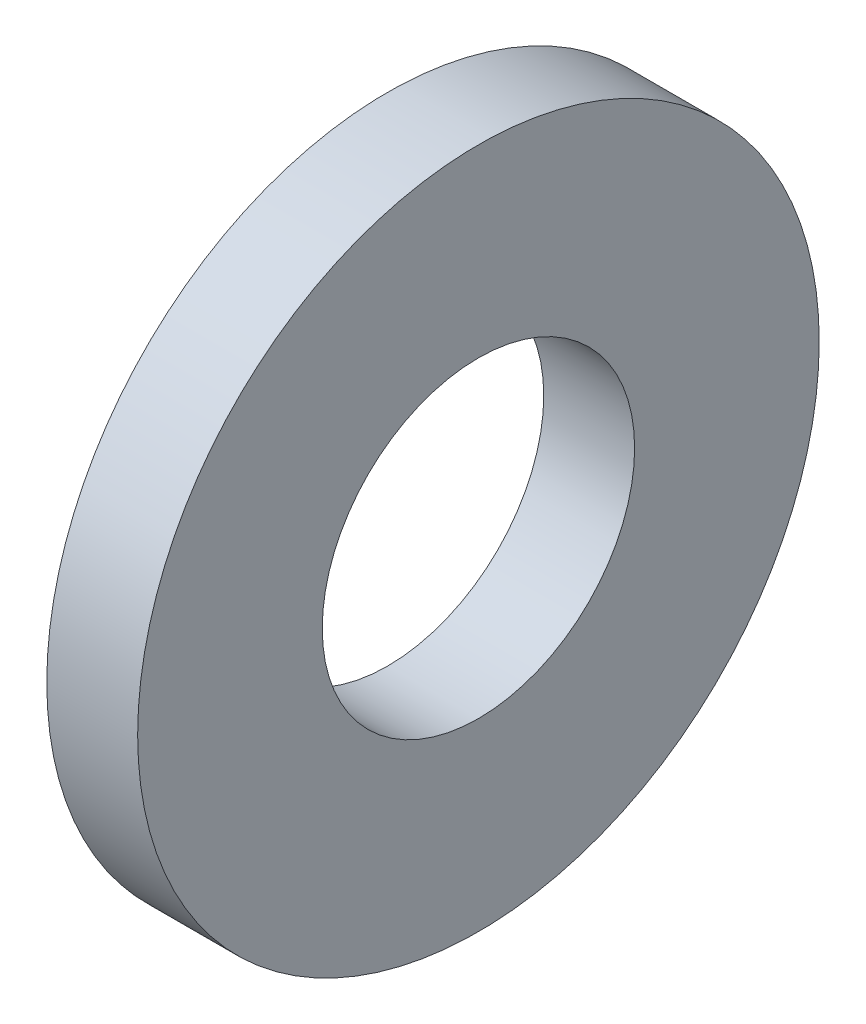
ISO-10303-21;
HEADER;
FILE_DESCRIPTION(('STEP AP214'),'2;1');
FILE_NAME('part.step','',(''),(''),'','','');
FILE_SCHEMA(('AUTOMOTIVE_DESIGN { 1 0 10303 214 1 1 1 1 }'));
ENDSEC;
DATA;
#1=APPLICATION_CONTEXT('core data for automotive mechanical design processes');
#2=APPLICATION_PROTOCOL_DEFINITION('international standard','automotive_design',2000,#1);
#3=PRODUCT_CONTEXT('',#1,'mechanical');
#4=PRODUCT('Part','Part','',(#3));
#5=PRODUCT_RELATED_PRODUCT_CATEGORY('part','',(#4));
#6=PRODUCT_DEFINITION_FORMATION('','',#4);
#7=PRODUCT_DEFINITION_CONTEXT('part definition',#1,'design');
#8=PRODUCT_DEFINITION('design','',#6,#7);
#9=PRODUCT_DEFINITION_SHAPE('','',#8);
#10=(LENGTH_UNIT() NAMED_UNIT(*) SI_UNIT(.MILLI.,.METRE.));
#11=(NAMED_UNIT(*) PLANE_ANGLE_UNIT() SI_UNIT($,.RADIAN.));
#12=(NAMED_UNIT(*) SI_UNIT($,.STERADIAN.) SOLID_ANGLE_UNIT());
#13=UNCERTAINTY_MEASURE_WITH_UNIT(LENGTH_MEASURE(1.E-05),#10,'distance_accuracy_value','');
#14=(GEOMETRIC_REPRESENTATION_CONTEXT(3) GLOBAL_UNCERTAINTY_ASSIGNED_CONTEXT((#13)) GLOBAL_UNIT_ASSIGNED_CONTEXT((#10,
#11,#12)) REPRESENTATION_CONTEXT('',''));
#15=CARTESIAN_POINT('',(0.,0.,0.));
#16=DIRECTION('',(0.,0.,1.));
#17=DIRECTION('',(1.,0.,0.));
#18=AXIS2_PLACEMENT_3D('',#15,#16,#17);
#19=CARTESIAN_POINT('',(1.6,0.,0.));
#20=DIRECTION('',(1.,0.,0.));
#21=DIRECTION('',(0.,0.,-1.));
#22=AXIS2_PLACEMENT_3D('',#19,#20,#21);
#23=PLANE('',#22);
#24=CARTESIAN_POINT('',(1.6,0.,0.));
#25=DIRECTION('',(1.,0.,0.));
#26=DIRECTION('',(0.,0.,-1.));
#27=AXIS2_PLACEMENT_3D('',#24,#25,#26);
#28=CIRCLE('',#27,6.);
#29=CARTESIAN_POINT('',(1.6,0.,-6.));
#30=VERTEX_POINT('',#29);
#31=EDGE_CURVE('E10',#30,#30,#28,.T.);
#32=ORIENTED_EDGE('',*,*,#31,.T.);
#33=EDGE_LOOP('',(#32));
#34=FACE_BOUND('',#33,.T.);
#35=CARTESIAN_POINT('',(1.6,0.,0.));
#36=DIRECTION('',(1.,0.,0.));
#37=DIRECTION('',(0.,0.,-1.));
#38=AXIS2_PLACEMENT_3D('',#35,#36,#37);
#39=CIRCLE('',#38,2.75);
#40=CARTESIAN_POINT('',(1.6,0.,-2.75));
#41=VERTEX_POINT('',#40);
#42=EDGE_CURVE('E41',#41,#41,#39,.T.);
#43=ORIENTED_EDGE('',*,*,#42,.F.);
#44=EDGE_LOOP('',(#43));
#45=FACE_BOUND('',#44,.T.);
#46=ADVANCED_FACE('F30',(#34,#45),#23,.T.);
#47=CARTESIAN_POINT('',(0.,0.,0.));
#48=DIRECTION('',(1.,0.,0.));
#49=DIRECTION('',(0.,0.,-1.));
#50=AXIS2_PLACEMENT_3D('',#47,#48,#49);
#51=PLANE('',#50);
#52=CARTESIAN_POINT('',(0.,0.,0.));
#53=DIRECTION('',(1.,0.,0.));
#54=DIRECTION('',(0.,0.,-1.));
#55=AXIS2_PLACEMENT_3D('',#52,#53,#54);
#56=CIRCLE('',#55,6.);
#57=CARTESIAN_POINT('',(0.,0.,-6.));
#58=VERTEX_POINT('',#57);
#59=EDGE_CURVE('E34',#58,#58,#56,.T.);
#60=ORIENTED_EDGE('',*,*,#59,.F.);
#61=EDGE_LOOP('',(#60));
#62=FACE_BOUND('',#61,.T.);
#63=CARTESIAN_POINT('',(0.,0.,0.));
#64=DIRECTION('',(1.,0.,0.));
#65=DIRECTION('',(0.,0.,-1.));
#66=AXIS2_PLACEMENT_3D('',#63,#64,#65);
#67=CIRCLE('',#66,2.75);
#68=CARTESIAN_POINT('',(0.,0.,-2.75));
#69=VERTEX_POINT('',#68);
#70=EDGE_CURVE('E43',#69,#69,#67,.T.);
#71=ORIENTED_EDGE('',*,*,#70,.T.);
#72=EDGE_LOOP('',(#71));
#73=FACE_BOUND('',#72,.T.);
#74=ADVANCED_FACE('F53',(#62,#73),#51,.F.);
#75=CARTESIAN_POINT('',(1.6,0.,0.));
#76=DIRECTION('',(-1.,0.,0.));
#77=DIRECTION('',(0.,0.,1.));
#78=AXIS2_PLACEMENT_3D('',#75,#76,#77);
#79=CYLINDRICAL_SURFACE('',#78,6.);
#80=ORIENTED_EDGE('',*,*,#31,.F.);
#81=EDGE_LOOP('',(#80));
#82=FACE_BOUND('',#81,.T.);
#83=ORIENTED_EDGE('',*,*,#59,.T.);
#84=EDGE_LOOP('',(#83));
#85=FACE_BOUND('',#84,.T.);
#86=ADVANCED_FACE('F32',(#82,#85),#79,.T.);
#87=CARTESIAN_POINT('',(1.6,0.,0.));
#88=DIRECTION('',(-1.,0.,0.));
#89=DIRECTION('',(0.,0.,1.));
#90=AXIS2_PLACEMENT_3D('',#87,#88,#89);
#91=CYLINDRICAL_SURFACE('',#90,2.75);
#92=ORIENTED_EDGE('',*,*,#42,.T.);
#93=EDGE_LOOP('',(#92));
#94=FACE_BOUND('',#93,.T.);
#95=ORIENTED_EDGE('',*,*,#70,.F.);
#96=EDGE_LOOP('',(#95));
#97=FACE_BOUND('',#96,.T.);
#98=ADVANCED_FACE('F49',(#94,#97),#91,.F.);
#99=CLOSED_SHELL('',(#46,#74,#86,#98));
#100=MANIFOLD_SOLID_BREP('B2',#99);
#101=ADVANCED_BREP_SHAPE_REPRESENTATION('',(#18,#100),#14);
#102=SHAPE_DEFINITION_REPRESENTATION(#9,#101);
ENDSEC;
END-ISO-10303-21;
